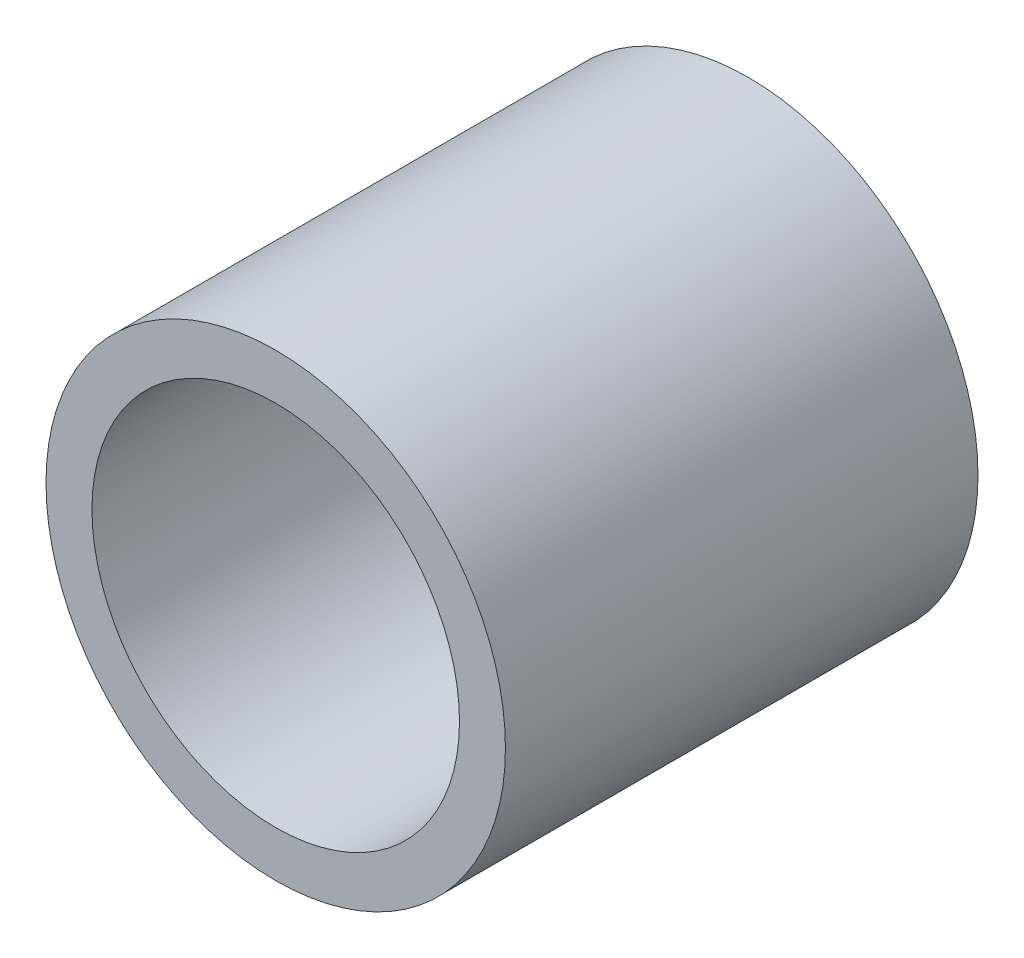
ISO-10303-21;
HEADER;
FILE_DESCRIPTION(('STEP AP214'),'2;1');
FILE_NAME('part.step','',(''),(''),'','','');
FILE_SCHEMA(('AUTOMOTIVE_DESIGN { 1 0 10303 214 1 1 1 1 }'));
ENDSEC;
DATA;
#1=APPLICATION_CONTEXT('core data for automotive mechanical design processes');
#2=APPLICATION_PROTOCOL_DEFINITION('international standard','automotive_design',2000,#1);
#3=PRODUCT_CONTEXT('',#1,'mechanical');
#4=PRODUCT('Part','Part','',(#3));
#5=PRODUCT_RELATED_PRODUCT_CATEGORY('part','',(#4));
#6=PRODUCT_DEFINITION_FORMATION('','',#4);
#7=PRODUCT_DEFINITION_CONTEXT('part definition',#1,'design');
#8=PRODUCT_DEFINITION('design','',#6,#7);
#9=PRODUCT_DEFINITION_SHAPE('','',#8);
#10=(LENGTH_UNIT() NAMED_UNIT(*) SI_UNIT(.MILLI.,.METRE.));
#11=(NAMED_UNIT(*) PLANE_ANGLE_UNIT() SI_UNIT($,.RADIAN.));
#12=(NAMED_UNIT(*) SI_UNIT($,.STERADIAN.) SOLID_ANGLE_UNIT());
#13=UNCERTAINTY_MEASURE_WITH_UNIT(LENGTH_MEASURE(1.E-05),#10,'distance_accuracy_value','');
#14=(GEOMETRIC_REPRESENTATION_CONTEXT(3) GLOBAL_UNCERTAINTY_ASSIGNED_CONTEXT((#13)) GLOBAL_UNIT_ASSIGNED_CONTEXT((#10,
#11,#12)) REPRESENTATION_CONTEXT('',''));
#15=CARTESIAN_POINT('',(0.,0.,0.));
#16=DIRECTION('',(0.,0.,1.));
#17=DIRECTION('',(1.,0.,0.));
#18=AXIS2_PLACEMENT_3D('',#15,#16,#17);
#19=CARTESIAN_POINT('',(0.,0.,36.));
#20=DIRECTION('',(0.,0.,1.));
#21=DIRECTION('',(1.,0.,0.));
#22=AXIS2_PLACEMENT_3D('',#19,#20,#21);
#23=PLANE('',#22);
#24=CARTESIAN_POINT('',(0.,0.,36.));
#25=DIRECTION('',(0.,0.,1.));
#26=DIRECTION('',(1.,0.,0.));
#27=AXIS2_PLACEMENT_3D('',#24,#25,#26);
#28=CIRCLE('',#27,17.5);
#29=CARTESIAN_POINT('',(17.5,0.,36.));
#30=VERTEX_POINT('',#29);
#31=EDGE_CURVE('E11',#30,#30,#28,.T.);
#32=ORIENTED_EDGE('',*,*,#31,.T.);
#33=EDGE_LOOP('',(#32));
#34=FACE_BOUND('',#33,.T.);
#35=CARTESIAN_POINT('',(0.,0.,36.));
#36=DIRECTION('',(0.,0.,1.));
#37=DIRECTION('',(1.,0.,0.));
#38=AXIS2_PLACEMENT_3D('',#35,#36,#37);
#39=CIRCLE('',#38,14.);
#40=CARTESIAN_POINT('',(14.,0.,36.));
#41=VERTEX_POINT('',#40);
#42=EDGE_CURVE('E62',#41,#41,#39,.T.);
#43=ORIENTED_EDGE('',*,*,#42,.F.);
#44=EDGE_LOOP('',(#43));
#45=FACE_BOUND('',#44,.T.);
#46=ADVANCED_FACE('F45',(#34,#45),#23,.T.);
#47=CARTESIAN_POINT('',(0.,0.,0.));
#48=DIRECTION('',(0.,0.,1.));
#49=DIRECTION('',(1.,0.,0.));
#50=AXIS2_PLACEMENT_3D('',#47,#48,#49);
#51=PLANE('',#50);
#52=CARTESIAN_POINT('',(0.,0.,0.));
#53=DIRECTION('',(0.,0.,1.));
#54=DIRECTION('',(1.,0.,0.));
#55=AXIS2_PLACEMENT_3D('',#52,#53,#54);
#56=CIRCLE('',#55,17.5);
#57=CARTESIAN_POINT('',(17.5,0.,0.));
#58=VERTEX_POINT('',#57);
#59=EDGE_CURVE('E50',#58,#58,#56,.T.);
#60=ORIENTED_EDGE('',*,*,#59,.F.);
#61=EDGE_LOOP('',(#60));
#62=FACE_BOUND('',#61,.T.);
#63=CARTESIAN_POINT('',(0.,0.,0.));
#64=DIRECTION('',(0.,0.,1.));
#65=DIRECTION('',(1.,0.,0.));
#66=AXIS2_PLACEMENT_3D('',#63,#64,#65);
#67=CIRCLE('',#66,14.);
#68=CARTESIAN_POINT('',(14.,0.,0.));
#69=VERTEX_POINT('',#68);
#70=EDGE_CURVE('E64',#69,#69,#67,.T.);
#71=ORIENTED_EDGE('',*,*,#70,.T.);
#72=EDGE_LOOP('',(#71));
#73=FACE_BOUND('',#72,.T.);
#74=ADVANCED_FACE('F79',(#62,#73),#51,.F.);
#75=CARTESIAN_POINT('',(0.,0.,36.));
#76=DIRECTION('',(0.,0.,-1.));
#77=DIRECTION('',(-1.,0.,0.));
#78=AXIS2_PLACEMENT_3D('',#75,#76,#77);
#79=CYLINDRICAL_SURFACE('',#78,17.5);
#80=ORIENTED_EDGE('',*,*,#31,.F.);
#81=EDGE_LOOP('',(#80));
#82=FACE_BOUND('',#81,.T.);
#83=ORIENTED_EDGE('',*,*,#59,.T.);
#84=EDGE_LOOP('',(#83));
#85=FACE_BOUND('',#84,.T.);
#86=ADVANCED_FACE('F48',(#82,#85),#79,.T.);
#87=CARTESIAN_POINT('',(0.,0.,36.));
#88=DIRECTION('',(0.,0.,-1.));
#89=DIRECTION('',(-1.,0.,0.));
#90=AXIS2_PLACEMENT_3D('',#87,#88,#89);
#91=CYLINDRICAL_SURFACE('',#90,14.);
#92=ORIENTED_EDGE('',*,*,#42,.T.);
#93=EDGE_LOOP('',(#92));
#94=FACE_BOUND('',#93,.T.);
#95=ORIENTED_EDGE('',*,*,#70,.F.);
#96=EDGE_LOOP('',(#95));
#97=FACE_BOUND('',#96,.T.);
#98=ADVANCED_FACE('F81',(#94,#97),#91,.F.);
#99=CLOSED_SHELL('',(#46,#74,#86,#98));
#100=MANIFOLD_SOLID_BREP('B2',#99);
#101=ADVANCED_BREP_SHAPE_REPRESENTATION('',(#18,#100),#14);
#102=SHAPE_DEFINITION_REPRESENTATION(#9,#101);
ENDSEC;
END-ISO-10303-21;
